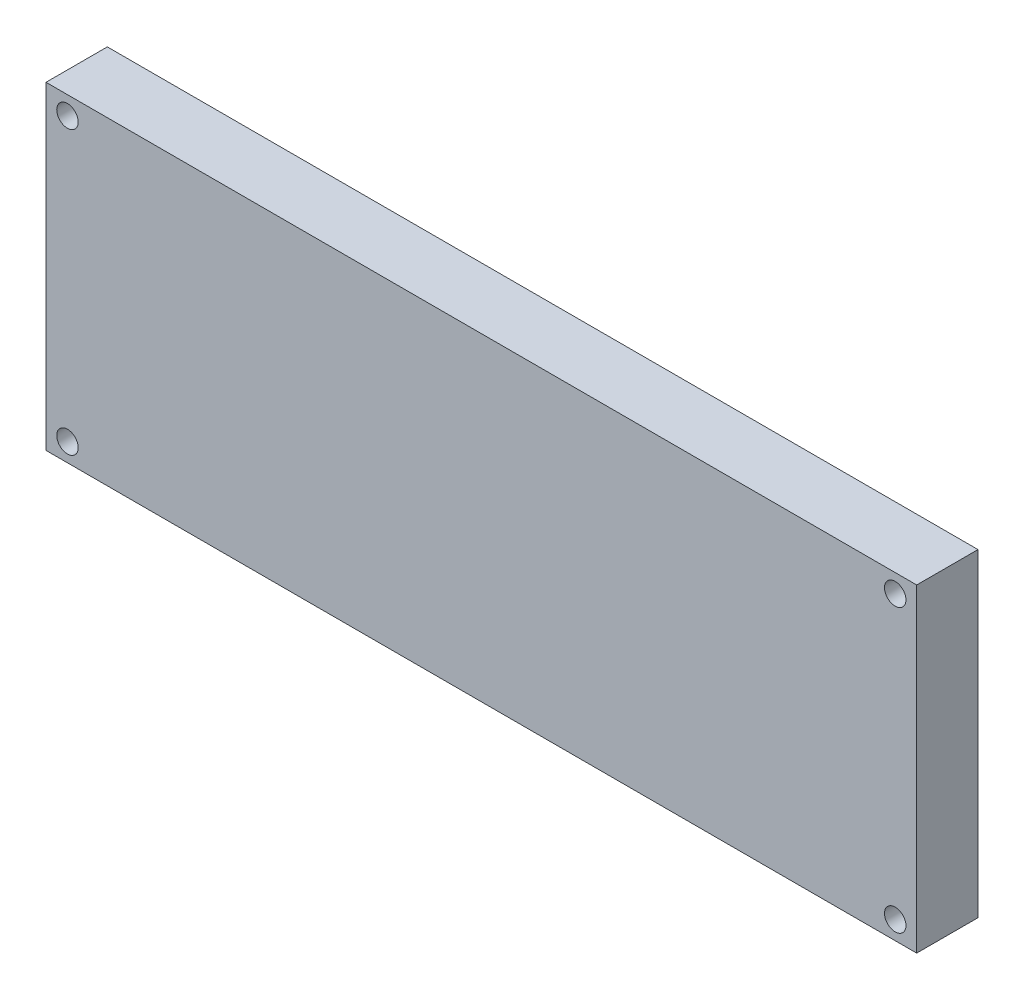
ISO-10303-21;
HEADER;
FILE_DESCRIPTION(('STEP AP214'),'2;1');
FILE_NAME('part.step','',(''),(''),'','','');
FILE_SCHEMA(('AUTOMOTIVE_DESIGN { 1 0 10303 214 1 1 1 1 }'));
ENDSEC;
DATA;
#1=APPLICATION_CONTEXT('core data for automotive mechanical design processes');
#2=APPLICATION_PROTOCOL_DEFINITION('international standard','automotive_design',2000,#1);
#3=PRODUCT_CONTEXT('',#1,'mechanical');
#4=PRODUCT('Part','Part','',(#3));
#5=PRODUCT_RELATED_PRODUCT_CATEGORY('part','',(#4));
#6=PRODUCT_DEFINITION_FORMATION('','',#4);
#7=PRODUCT_DEFINITION_CONTEXT('part definition',#1,'design');
#8=PRODUCT_DEFINITION('design','',#6,#7);
#9=PRODUCT_DEFINITION_SHAPE('','',#8);
#10=(LENGTH_UNIT() NAMED_UNIT(*) SI_UNIT(.MILLI.,.METRE.));
#11=(NAMED_UNIT(*) PLANE_ANGLE_UNIT() SI_UNIT($,.RADIAN.));
#12=(NAMED_UNIT(*) SI_UNIT($,.STERADIAN.) SOLID_ANGLE_UNIT());
#13=UNCERTAINTY_MEASURE_WITH_UNIT(LENGTH_MEASURE(1.E-05),#10,'distance_accuracy_value','');
#14=(GEOMETRIC_REPRESENTATION_CONTEXT(3) GLOBAL_UNCERTAINTY_ASSIGNED_CONTEXT((#13)) GLOBAL_UNIT_ASSIGNED_CONTEXT((#10,
#11,#12)) REPRESENTATION_CONTEXT('',''));
#15=CARTESIAN_POINT('',(0.,0.,0.));
#16=DIRECTION('',(0.,0.,1.));
#17=DIRECTION('',(1.,0.,0.));
#18=AXIS2_PLACEMENT_3D('',#15,#16,#17);
#19=CARTESIAN_POINT('',(0.,0.,10.));
#20=DIRECTION('',(0.,0.,-1.));
#21=DIRECTION('',(-1.,0.,0.));
#22=AXIS2_PLACEMENT_3D('',#19,#20,#21);
#23=PLANE('',#22);
#24=DIRECTION('',(0.,-1.,0.));
#25=VECTOR('',#24,1.);
#26=CARTESIAN_POINT('',(0.,0.,10.));
#27=LINE('',#26,#25);
#28=CARTESIAN_POINT('',(0.,52.,10.));
#29=VERTEX_POINT('',#28);
#30=CARTESIAN_POINT('',(0.,0.,10.));
#31=VERTEX_POINT('',#30);
#32=EDGE_CURVE('E89',#29,#31,#27,.T.);
#33=ORIENTED_EDGE('',*,*,#32,.T.);
#34=DIRECTION('',(1.,0.,0.));
#35=VECTOR('',#34,1.);
#36=CARTESIAN_POINT('',(0.,0.,10.));
#37=LINE('',#36,#35);
#38=CARTESIAN_POINT('',(142.,0.,10.));
#39=VERTEX_POINT('',#38);
#40=EDGE_CURVE('E84',#31,#39,#37,.T.);
#41=ORIENTED_EDGE('',*,*,#40,.T.);
#42=DIRECTION('',(0.,1.,0.));
#43=VECTOR('',#42,1.);
#44=CARTESIAN_POINT('',(142.,0.,10.));
#45=LINE('',#44,#43);
#46=CARTESIAN_POINT('',(142.,52.,10.));
#47=VERTEX_POINT('',#46);
#48=EDGE_CURVE('E87',#39,#47,#45,.T.);
#49=ORIENTED_EDGE('',*,*,#48,.T.);
#50=DIRECTION('',(-1.,0.,0.));
#51=VECTOR('',#50,1.);
#52=CARTESIAN_POINT('',(0.,52.,10.));
#53=LINE('',#52,#51);
#54=EDGE_CURVE('E54',#47,#29,#53,.T.);
#55=ORIENTED_EDGE('',*,*,#54,.T.);
#56=EDGE_LOOP('',(#33,#41,#49,#55));
#57=FACE_BOUND('',#56,.T.);
#58=CARTESIAN_POINT('',(138.5,49.,10.));
#59=DIRECTION('',(0.,0.,1.));
#60=DIRECTION('',(1.,0.,0.));
#61=AXIS2_PLACEMENT_3D('',#58,#59,#60);
#62=CIRCLE('',#61,1.75000000000001);
#63=CARTESIAN_POINT('',(140.25,49.,10.));
#64=VERTEX_POINT('',#63);
#65=EDGE_CURVE('E104',#64,#64,#62,.T.);
#66=ORIENTED_EDGE('',*,*,#65,.F.);
#67=EDGE_LOOP('',(#66));
#68=FACE_BOUND('',#67,.T.);
#69=CARTESIAN_POINT('',(3.49999999999998,49.,10.));
#70=DIRECTION('',(0.,0.,1.));
#71=DIRECTION('',(-1.,0.,0.));
#72=AXIS2_PLACEMENT_3D('',#69,#70,#71);
#73=CIRCLE('',#72,1.75000000000001);
#74=CARTESIAN_POINT('',(1.74999999999996,49.,10.));
#75=VERTEX_POINT('',#74);
#76=EDGE_CURVE('E119',#75,#75,#73,.T.);
#77=ORIENTED_EDGE('',*,*,#76,.F.);
#78=EDGE_LOOP('',(#77));
#79=FACE_BOUND('',#78,.T.);
#80=CARTESIAN_POINT('',(3.49999999999998,3.,10.));
#81=DIRECTION('',(0.,0.,1.));
#82=DIRECTION('',(1.,0.,0.));
#83=AXIS2_PLACEMENT_3D('',#80,#81,#82);
#84=CIRCLE('',#83,1.75000000000001);
#85=CARTESIAN_POINT('',(5.24999999999999,3.,10.));
#86=VERTEX_POINT('',#85);
#87=EDGE_CURVE('E125',#86,#86,#84,.T.);
#88=ORIENTED_EDGE('',*,*,#87,.F.);
#89=EDGE_LOOP('',(#88));
#90=FACE_BOUND('',#89,.T.);
#91=CARTESIAN_POINT('',(138.5,3.,10.));
#92=DIRECTION('',(0.,0.,1.));
#93=DIRECTION('',(-1.,0.,0.));
#94=AXIS2_PLACEMENT_3D('',#91,#92,#93);
#95=CIRCLE('',#94,1.75000000000001);
#96=CARTESIAN_POINT('',(136.75,3.,10.));
#97=VERTEX_POINT('',#96);
#98=EDGE_CURVE('E131',#97,#97,#95,.T.);
#99=ORIENTED_EDGE('',*,*,#98,.F.);
#100=EDGE_LOOP('',(#99));
#101=FACE_BOUND('',#100,.T.);
#102=ADVANCED_FACE('F37',(#57,#68,#79,#90,#101),#23,.F.);
#103=CARTESIAN_POINT('',(0.,0.,0.));
#104=DIRECTION('',(0.,0.,-1.));
#105=DIRECTION('',(-1.,0.,0.));
#106=AXIS2_PLACEMENT_3D('',#103,#104,#105);
#107=PLANE('',#106);
#108=CARTESIAN_POINT('',(3.49999999999998,3.,0.));
#109=DIRECTION('',(0.,0.,1.));
#110=DIRECTION('',(1.,0.,0.));
#111=AXIS2_PLACEMENT_3D('',#108,#109,#110);
#112=CIRCLE('',#111,1.75000000000001);
#113=CARTESIAN_POINT('',(5.24999999999999,3.,0.));
#114=VERTEX_POINT('',#113);
#115=EDGE_CURVE('E128',#114,#114,#112,.T.);
#116=ORIENTED_EDGE('',*,*,#115,.T.);
#117=EDGE_LOOP('',(#116));
#118=FACE_BOUND('',#117,.T.);
#119=CARTESIAN_POINT('',(138.5,49.,0.));
#120=DIRECTION('',(0.,0.,1.));
#121=DIRECTION('',(1.,0.,0.));
#122=AXIS2_PLACEMENT_3D('',#119,#120,#121);
#123=CIRCLE('',#122,1.75000000000001);
#124=CARTESIAN_POINT('',(140.25,49.,0.));
#125=VERTEX_POINT('',#124);
#126=EDGE_CURVE('E116',#125,#125,#123,.T.);
#127=ORIENTED_EDGE('',*,*,#126,.T.);
#128=EDGE_LOOP('',(#127));
#129=FACE_BOUND('',#128,.T.);
#130=DIRECTION('',(0.,-1.,0.));
#131=VECTOR('',#130,1.);
#132=CARTESIAN_POINT('',(0.,0.,0.));
#133=LINE('',#132,#131);
#134=CARTESIAN_POINT('',(0.,52.,0.));
#135=VERTEX_POINT('',#134);
#136=CARTESIAN_POINT('',(0.,0.,0.));
#137=VERTEX_POINT('',#136);
#138=EDGE_CURVE('E101',#135,#137,#133,.T.);
#139=ORIENTED_EDGE('',*,*,#138,.F.);
#140=DIRECTION('',(-1.,0.,0.));
#141=VECTOR('',#140,1.);
#142=CARTESIAN_POINT('',(0.,52.,0.));
#143=LINE('',#142,#141);
#144=CARTESIAN_POINT('',(142.,52.,0.));
#145=VERTEX_POINT('',#144);
#146=EDGE_CURVE('E77',#145,#135,#143,.T.);
#147=ORIENTED_EDGE('',*,*,#146,.F.);
#148=DIRECTION('',(0.,1.,0.));
#149=VECTOR('',#148,1.);
#150=CARTESIAN_POINT('',(142.,0.,0.));
#151=LINE('',#150,#149);
#152=CARTESIAN_POINT('',(142.,0.,0.));
#153=VERTEX_POINT('',#152);
#154=EDGE_CURVE('E71',#153,#145,#151,.T.);
#155=ORIENTED_EDGE('',*,*,#154,.F.);
#156=DIRECTION('',(1.,0.,0.));
#157=VECTOR('',#156,1.);
#158=CARTESIAN_POINT('',(0.,0.,0.));
#159=LINE('',#158,#157);
#160=EDGE_CURVE('E93',#137,#153,#159,.T.);
#161=ORIENTED_EDGE('',*,*,#160,.F.);
#162=EDGE_LOOP('',(#139,#147,#155,#161));
#163=FACE_BOUND('',#162,.T.);
#164=CARTESIAN_POINT('',(3.49999999999998,49.,0.));
#165=DIRECTION('',(0.,0.,1.));
#166=DIRECTION('',(-1.,0.,0.));
#167=AXIS2_PLACEMENT_3D('',#164,#165,#166);
#168=CIRCLE('',#167,1.75000000000001);
#169=CARTESIAN_POINT('',(1.74999999999996,49.,0.));
#170=VERTEX_POINT('',#169);
#171=EDGE_CURVE('E122',#170,#170,#168,.T.);
#172=ORIENTED_EDGE('',*,*,#171,.T.);
#173=EDGE_LOOP('',(#172));
#174=FACE_BOUND('',#173,.T.);
#175=CARTESIAN_POINT('',(138.5,3.,0.));
#176=DIRECTION('',(0.,0.,1.));
#177=DIRECTION('',(-1.,0.,0.));
#178=AXIS2_PLACEMENT_3D('',#175,#176,#177);
#179=CIRCLE('',#178,1.75000000000001);
#180=CARTESIAN_POINT('',(136.75,3.,0.));
#181=VERTEX_POINT('',#180);
#182=EDGE_CURVE('E134',#181,#181,#179,.T.);
#183=ORIENTED_EDGE('',*,*,#182,.T.);
#184=EDGE_LOOP('',(#183));
#185=FACE_BOUND('',#184,.T.);
#186=ADVANCED_FACE('F112',(#118,#129,#163,#174,#185),#107,.T.);
#187=CARTESIAN_POINT('',(0.,0.,10.));
#188=DIRECTION('',(1.,0.,0.));
#189=DIRECTION('',(0.,0.,-1.));
#190=AXIS2_PLACEMENT_3D('',#187,#188,#189);
#191=PLANE('',#190);
#192=ORIENTED_EDGE('',*,*,#138,.T.);
#193=DIRECTION('',(0.,0.,-1.));
#194=VECTOR('',#193,1.);
#195=CARTESIAN_POINT('',(0.,0.,10.));
#196=LINE('',#195,#194);
#197=EDGE_CURVE('E11',#31,#137,#196,.T.);
#198=ORIENTED_EDGE('',*,*,#197,.F.);
#199=ORIENTED_EDGE('',*,*,#32,.F.);
#200=DIRECTION('',(0.,0.,-1.));
#201=VECTOR('',#200,1.);
#202=CARTESIAN_POINT('',(0.,52.,10.));
#203=LINE('',#202,#201);
#204=EDGE_CURVE('E97',#29,#135,#203,.T.);
#205=ORIENTED_EDGE('',*,*,#204,.T.);
#206=EDGE_LOOP('',(#192,#198,#199,#205));
#207=FACE_BOUND('',#206,.T.);
#208=ADVANCED_FACE('F39',(#207),#191,.F.);
#209=CARTESIAN_POINT('',(0.,0.,10.));
#210=DIRECTION('',(0.,1.,0.));
#211=DIRECTION('',(0.,0.,1.));
#212=AXIS2_PLACEMENT_3D('',#209,#210,#211);
#213=PLANE('',#212);
#214=ORIENTED_EDGE('',*,*,#160,.T.);
#215=DIRECTION('',(0.,0.,-1.));
#216=VECTOR('',#215,1.);
#217=CARTESIAN_POINT('',(142.,0.,10.));
#218=LINE('',#217,#216);
#219=EDGE_CURVE('E46',#39,#153,#218,.T.);
#220=ORIENTED_EDGE('',*,*,#219,.F.);
#221=ORIENTED_EDGE('',*,*,#40,.F.);
#222=ORIENTED_EDGE('',*,*,#197,.T.);
#223=EDGE_LOOP('',(#214,#220,#221,#222));
#224=FACE_BOUND('',#223,.T.);
#225=ADVANCED_FACE('F92',(#224),#213,.F.);
#226=CARTESIAN_POINT('',(142.,0.,10.));
#227=DIRECTION('',(-1.,0.,0.));
#228=DIRECTION('',(0.,0.,1.));
#229=AXIS2_PLACEMENT_3D('',#226,#227,#228);
#230=PLANE('',#229);
#231=ORIENTED_EDGE('',*,*,#154,.T.);
#232=DIRECTION('',(0.,0.,-1.));
#233=VECTOR('',#232,1.);
#234=CARTESIAN_POINT('',(142.,52.,10.));
#235=LINE('',#234,#233);
#236=EDGE_CURVE('E94',#47,#145,#235,.T.);
#237=ORIENTED_EDGE('',*,*,#236,.F.);
#238=ORIENTED_EDGE('',*,*,#48,.F.);
#239=ORIENTED_EDGE('',*,*,#219,.T.);
#240=EDGE_LOOP('',(#231,#237,#238,#239));
#241=FACE_BOUND('',#240,.T.);
#242=ADVANCED_FACE('F95',(#241),#230,.F.);
#243=CARTESIAN_POINT('',(0.,52.,10.));
#244=DIRECTION('',(0.,-1.,0.));
#245=DIRECTION('',(0.,0.,-1.));
#246=AXIS2_PLACEMENT_3D('',#243,#244,#245);
#247=PLANE('',#246);
#248=ORIENTED_EDGE('',*,*,#146,.T.);
#249=ORIENTED_EDGE('',*,*,#204,.F.);
#250=ORIENTED_EDGE('',*,*,#54,.F.);
#251=ORIENTED_EDGE('',*,*,#236,.T.);
#252=EDGE_LOOP('',(#248,#249,#250,#251));
#253=FACE_BOUND('',#252,.T.);
#254=ADVANCED_FACE('F109',(#253),#247,.F.);
#255=CARTESIAN_POINT('',(138.5,49.,10.));
#256=DIRECTION('',(0.,0.,-1.));
#257=DIRECTION('',(-1.,0.,0.));
#258=AXIS2_PLACEMENT_3D('',#255,#256,#257);
#259=CYLINDRICAL_SURFACE('',#258,1.75000000000001);
#260=ORIENTED_EDGE('',*,*,#65,.T.);
#261=EDGE_LOOP('',(#260));
#262=FACE_BOUND('',#261,.T.);
#263=ORIENTED_EDGE('',*,*,#126,.F.);
#264=EDGE_LOOP('',(#263));
#265=FACE_BOUND('',#264,.T.);
#266=ADVANCED_FACE('F151',(#262,#265),#259,.F.);
#267=CARTESIAN_POINT('',(3.49999999999998,49.,10.));
#268=DIRECTION('',(0.,0.,-1.));
#269=DIRECTION('',(-1.,0.,0.));
#270=AXIS2_PLACEMENT_3D('',#267,#268,#269);
#271=CYLINDRICAL_SURFACE('',#270,1.75000000000001);
#272=ORIENTED_EDGE('',*,*,#76,.T.);
#273=EDGE_LOOP('',(#272));
#274=FACE_BOUND('',#273,.T.);
#275=ORIENTED_EDGE('',*,*,#171,.F.);
#276=EDGE_LOOP('',(#275));
#277=FACE_BOUND('',#276,.T.);
#278=ADVANCED_FACE('F197',(#274,#277),#271,.F.);
#279=CARTESIAN_POINT('',(3.49999999999998,3.,10.));
#280=DIRECTION('',(0.,0.,-1.));
#281=DIRECTION('',(-1.,0.,0.));
#282=AXIS2_PLACEMENT_3D('',#279,#280,#281);
#283=CYLINDRICAL_SURFACE('',#282,1.75000000000001);
#284=ORIENTED_EDGE('',*,*,#87,.T.);
#285=EDGE_LOOP('',(#284));
#286=FACE_BOUND('',#285,.T.);
#287=ORIENTED_EDGE('',*,*,#115,.F.);
#288=EDGE_LOOP('',(#287));
#289=FACE_BOUND('',#288,.T.);
#290=ADVANCED_FACE('F205',(#286,#289),#283,.F.);
#291=CARTESIAN_POINT('',(138.5,3.,10.));
#292=DIRECTION('',(0.,0.,-1.));
#293=DIRECTION('',(-1.,0.,0.));
#294=AXIS2_PLACEMENT_3D('',#291,#292,#293);
#295=CYLINDRICAL_SURFACE('',#294,1.75000000000001);
#296=ORIENTED_EDGE('',*,*,#98,.T.);
#297=EDGE_LOOP('',(#296));
#298=FACE_BOUND('',#297,.T.);
#299=ORIENTED_EDGE('',*,*,#182,.F.);
#300=EDGE_LOOP('',(#299));
#301=FACE_BOUND('',#300,.T.);
#302=ADVANCED_FACE('F140',(#298,#301),#295,.F.);
#303=CLOSED_SHELL('',(#102,#186,#208,#225,#242,#254,#266,#278,#290,#302));
#304=MANIFOLD_SOLID_BREP('B2',#303);
#305=ADVANCED_BREP_SHAPE_REPRESENTATION('',(#18,#304),#14);
#306=SHAPE_DEFINITION_REPRESENTATION(#9,#305);
ENDSEC;
END-ISO-10303-21;
